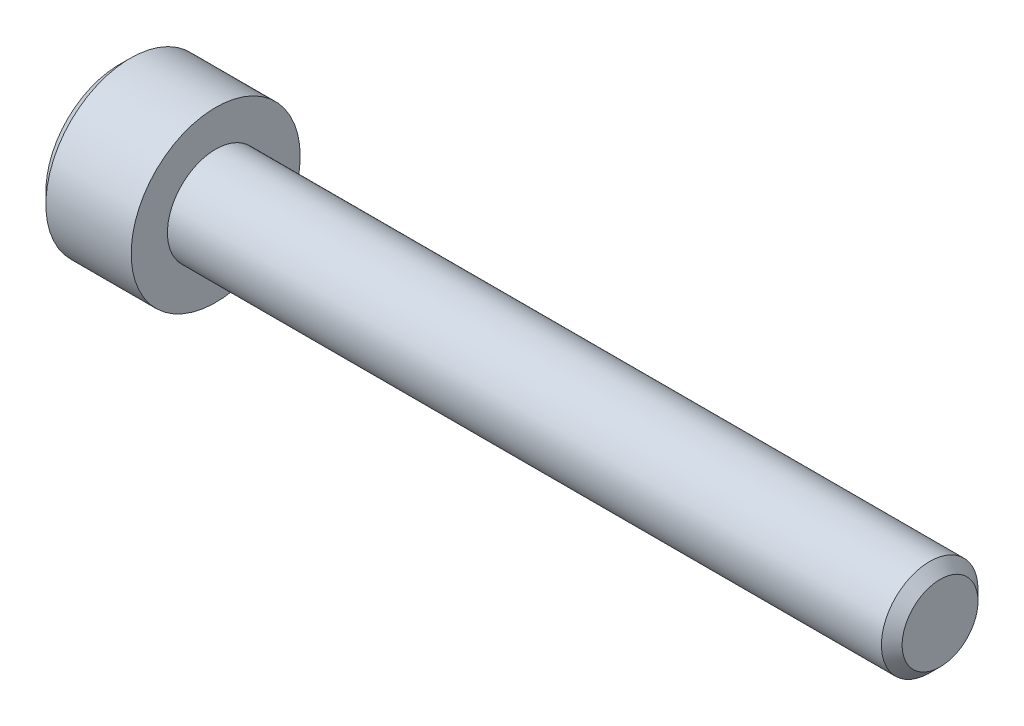
ISO-10303-21;
HEADER;
FILE_DESCRIPTION(('STEP AP214'),'2;1');
FILE_NAME('part.step','',(''),(''),'','','');
FILE_SCHEMA(('AUTOMOTIVE_DESIGN { 1 0 10303 214 1 1 1 1 }'));
ENDSEC;
DATA;
#1=APPLICATION_CONTEXT('core data for automotive mechanical design processes');
#2=APPLICATION_PROTOCOL_DEFINITION('international standard','automotive_design',2000,#1);
#3=PRODUCT_CONTEXT('',#1,'mechanical');
#4=PRODUCT('Part','Part','',(#3));
#5=PRODUCT_RELATED_PRODUCT_CATEGORY('part','',(#4));
#6=PRODUCT_DEFINITION_FORMATION('','',#4);
#7=PRODUCT_DEFINITION_CONTEXT('part definition',#1,'design');
#8=PRODUCT_DEFINITION('design','',#6,#7);
#9=PRODUCT_DEFINITION_SHAPE('','',#8);
#10=(LENGTH_UNIT() NAMED_UNIT(*) SI_UNIT(.MILLI.,.METRE.));
#11=(NAMED_UNIT(*) PLANE_ANGLE_UNIT() SI_UNIT($,.RADIAN.));
#12=(NAMED_UNIT(*) SI_UNIT($,.STERADIAN.) SOLID_ANGLE_UNIT());
#13=UNCERTAINTY_MEASURE_WITH_UNIT(LENGTH_MEASURE(1.E-05),#10,'distance_accuracy_value','');
#14=(GEOMETRIC_REPRESENTATION_CONTEXT(3) GLOBAL_UNCERTAINTY_ASSIGNED_CONTEXT((#13)) GLOBAL_UNIT_ASSIGNED_CONTEXT((#10,
#11,#12)) REPRESENTATION_CONTEXT('',''));
#15=CARTESIAN_POINT('',(0.,0.,0.));
#16=DIRECTION('',(0.,0.,1.));
#17=DIRECTION('',(1.,0.,0.));
#18=AXIS2_PLACEMENT_3D('',#15,#16,#17);
#19=CARTESIAN_POINT('',(-2.,0.,0.));
#20=DIRECTION('',(-1.,0.,0.));
#21=DIRECTION('',(0.,0.,1.));
#22=AXIS2_PLACEMENT_3D('',#19,#20,#21);
#23=CONICAL_SURFACE('',#22,1.5,1.30899693899575);
#24=CARTESIAN_POINT('',(-2.,0.,0.));
#25=DIRECTION('',(1.,0.,0.));
#26=DIRECTION('',(0.,0.,-1.));
#27=AXIS2_PLACEMENT_3D('',#24,#25,#26);
#28=CIRCLE('',#27,1.5);
#29=CARTESIAN_POINT('',(-2.,1.29903810567666,-0.75));
#30=VERTEX_POINT('',#29);
#31=CARTESIAN_POINT('',(-2.,1.29903810567666,0.75));
#32=VERTEX_POINT('',#31);
#33=EDGE_CURVE('E147',#30,#32,#28,.T.);
#34=ORIENTED_EDGE('',*,*,#33,.F.);
#35=CARTESIAN_POINT('',(-2.,0.,0.));
#36=DIRECTION('',(1.,0.,0.));
#37=DIRECTION('',(0.,0.,-1.));
#38=AXIS2_PLACEMENT_3D('',#35,#36,#37);
#39=CIRCLE('',#38,1.5);
#40=CARTESIAN_POINT('',(-2.,0.,-1.5));
#41=VERTEX_POINT('',#40);
#42=EDGE_CURVE('E255',#41,#30,#39,.T.);
#43=ORIENTED_EDGE('',*,*,#42,.F.);
#44=CARTESIAN_POINT('',(-2.,0.,0.));
#45=DIRECTION('',(1.,0.,0.));
#46=DIRECTION('',(0.,0.,-1.));
#47=AXIS2_PLACEMENT_3D('',#44,#45,#46);
#48=CIRCLE('',#47,1.5);
#49=CARTESIAN_POINT('',(-2.,-1.29903810567666,-0.75));
#50=VERTEX_POINT('',#49);
#51=EDGE_CURVE('E10',#50,#41,#48,.T.);
#52=ORIENTED_EDGE('',*,*,#51,.F.);
#53=CARTESIAN_POINT('',(-2.,0.,0.));
#54=DIRECTION('',(1.,0.,0.));
#55=DIRECTION('',(0.,0.,-1.));
#56=AXIS2_PLACEMENT_3D('',#53,#54,#55);
#57=CIRCLE('',#56,1.5);
#58=CARTESIAN_POINT('',(-2.,-1.29903810567666,0.75));
#59=VERTEX_POINT('',#58);
#60=EDGE_CURVE('E25',#59,#50,#57,.T.);
#61=ORIENTED_EDGE('',*,*,#60,.F.);
#62=CARTESIAN_POINT('',(-2.,0.,0.));
#63=DIRECTION('',(1.,0.,0.));
#64=DIRECTION('',(0.,0.,-1.));
#65=AXIS2_PLACEMENT_3D('',#62,#63,#64);
#66=CIRCLE('',#65,1.5);
#67=CARTESIAN_POINT('',(-2.,0.,1.5));
#68=VERTEX_POINT('',#67);
#69=EDGE_CURVE('E129',#68,#59,#66,.T.);
#70=ORIENTED_EDGE('',*,*,#69,.F.);
#71=CARTESIAN_POINT('',(-2.,0.,0.));
#72=DIRECTION('',(1.,0.,0.));
#73=DIRECTION('',(0.,0.,-1.));
#74=AXIS2_PLACEMENT_3D('',#71,#72,#73);
#75=CIRCLE('',#74,1.5);
#76=EDGE_CURVE('E37',#32,#68,#75,.T.);
#77=ORIENTED_EDGE('',*,*,#76,.F.);
#78=EDGE_LOOP('',(#34,#43,#52,#61,#70,#77));
#79=FACE_BOUND('',#78,.T.);
#80=CARTESIAN_POINT('',(-1.59807621135332,0.,0.));
#81=VERTEX_POINT('',#80);
#82=VERTEX_LOOP('',#81);
#83=FACE_BOUND('',#82,.T.);
#84=ADVANCED_FACE('F16',(#79,#83),#23,.F.);
#85=CARTESIAN_POINT('',(-2.,0.,0.));
#86=DIRECTION('',(1.,0.,0.));
#87=DIRECTION('',(0.,1.,0.));
#88=AXIS2_PLACEMENT_3D('',#85,#86,#87);
#89=PLANE('',#88);
#90=ORIENTED_EDGE('',*,*,#51,.T.);
#91=DIRECTION('',(0.,1.,0.));
#92=VECTOR('',#91,1.);
#93=CARTESIAN_POINT('',(-2.,-0.866025403784439,-1.5));
#94=LINE('',#93,#92);
#95=CARTESIAN_POINT('',(-2.,-0.866025403784439,-1.5));
#96=VERTEX_POINT('',#95);
#97=EDGE_CURVE('E228',#96,#41,#94,.T.);
#98=ORIENTED_EDGE('',*,*,#97,.F.);
#99=DIRECTION('',(0.,0.5,-0.866025403784439));
#100=VECTOR('',#99,1.);
#101=CARTESIAN_POINT('',(-2.,-1.73205080756888,0.));
#102=LINE('',#101,#100);
#103=EDGE_CURVE('E221',#50,#96,#102,.T.);
#104=ORIENTED_EDGE('',*,*,#103,.F.);
#105=EDGE_LOOP('',(#90,#98,#104));
#106=FACE_BOUND('',#105,.T.);
#107=ADVANCED_FACE('F268',(#106),#89,.F.);
#108=CARTESIAN_POINT('',(-2.,0.,0.));
#109=DIRECTION('',(1.,0.,0.));
#110=DIRECTION('',(0.,1.,0.));
#111=AXIS2_PLACEMENT_3D('',#108,#109,#110);
#112=PLANE('',#111);
#113=ORIENTED_EDGE('',*,*,#60,.T.);
#114=DIRECTION('',(0.,0.5,-0.866025403784439));
#115=VECTOR('',#114,1.);
#116=CARTESIAN_POINT('',(-2.,-1.73205080756888,0.));
#117=LINE('',#116,#115);
#118=CARTESIAN_POINT('',(-2.,-1.73205080756888,0.));
#119=VERTEX_POINT('',#118);
#120=EDGE_CURVE('E217',#119,#50,#117,.T.);
#121=ORIENTED_EDGE('',*,*,#120,.F.);
#122=DIRECTION('',(0.,-0.5,-0.866025403784439));
#123=VECTOR('',#122,1.);
#124=CARTESIAN_POINT('',(-2.,-0.866025403784439,1.5));
#125=LINE('',#124,#123);
#126=EDGE_CURVE('E210',#59,#119,#125,.T.);
#127=ORIENTED_EDGE('',*,*,#126,.F.);
#128=EDGE_LOOP('',(#113,#121,#127));
#129=FACE_BOUND('',#128,.T.);
#130=ADVANCED_FACE('F265',(#129),#112,.F.);
#131=CARTESIAN_POINT('',(-2.,0.,0.));
#132=DIRECTION('',(1.,0.,0.));
#133=DIRECTION('',(0.,1.,0.));
#134=AXIS2_PLACEMENT_3D('',#131,#132,#133);
#135=PLANE('',#134);
#136=ORIENTED_EDGE('',*,*,#69,.T.);
#137=DIRECTION('',(0.,-0.5,-0.866025403784439));
#138=VECTOR('',#137,1.);
#139=CARTESIAN_POINT('',(-2.,-0.866025403784439,1.5));
#140=LINE('',#139,#138);
#141=CARTESIAN_POINT('',(-2.,-0.866025403784439,1.5));
#142=VERTEX_POINT('',#141);
#143=EDGE_CURVE('E153',#142,#59,#140,.T.);
#144=ORIENTED_EDGE('',*,*,#143,.F.);
#145=DIRECTION('',(0.,-1.,0.));
#146=VECTOR('',#145,1.);
#147=CARTESIAN_POINT('',(-2.,0.866025403784439,1.5));
#148=LINE('',#147,#146);
#149=EDGE_CURVE('E150',#68,#142,#148,.T.);
#150=ORIENTED_EDGE('',*,*,#149,.F.);
#151=EDGE_LOOP('',(#136,#144,#150));
#152=FACE_BOUND('',#151,.T.);
#153=ADVANCED_FACE('F151',(#152),#135,.F.);
#154=CARTESIAN_POINT('',(-2.,0.,0.));
#155=DIRECTION('',(1.,0.,0.));
#156=DIRECTION('',(0.,1.,0.));
#157=AXIS2_PLACEMENT_3D('',#154,#155,#156);
#158=PLANE('',#157);
#159=ORIENTED_EDGE('',*,*,#76,.T.);
#160=DIRECTION('',(0.,-1.,0.));
#161=VECTOR('',#160,1.);
#162=CARTESIAN_POINT('',(-2.,0.866025403784439,1.5));
#163=LINE('',#162,#161);
#164=CARTESIAN_POINT('',(-2.,0.866025403784439,1.5));
#165=VERTEX_POINT('',#164);
#166=EDGE_CURVE('E142',#165,#68,#163,.T.);
#167=ORIENTED_EDGE('',*,*,#166,.F.);
#168=DIRECTION('',(0.,-0.5,0.866025403784439));
#169=VECTOR('',#168,1.);
#170=CARTESIAN_POINT('',(-2.,1.73205080756888,0.));
#171=LINE('',#170,#169);
#172=EDGE_CURVE('E144',#32,#165,#171,.T.);
#173=ORIENTED_EDGE('',*,*,#172,.F.);
#174=EDGE_LOOP('',(#159,#167,#173));
#175=FACE_BOUND('',#174,.T.);
#176=ADVANCED_FACE('F140',(#175),#158,.F.);
#177=CARTESIAN_POINT('',(-2.,0.,0.));
#178=DIRECTION('',(1.,0.,0.));
#179=DIRECTION('',(0.,1.,0.));
#180=AXIS2_PLACEMENT_3D('',#177,#178,#179);
#181=PLANE('',#180);
#182=DIRECTION('',(0.,0.5,0.866025403784439));
#183=VECTOR('',#182,1.);
#184=CARTESIAN_POINT('',(-2.,0.866025403784439,-1.5));
#185=LINE('',#184,#183);
#186=CARTESIAN_POINT('',(-2.,1.73205080756888,0.));
#187=VERTEX_POINT('',#186);
#188=EDGE_CURVE('E243',#30,#187,#185,.T.);
#189=ORIENTED_EDGE('',*,*,#188,.F.);
#190=ORIENTED_EDGE('',*,*,#33,.T.);
#191=DIRECTION('',(0.,-0.5,0.866025403784439));
#192=VECTOR('',#191,1.);
#193=CARTESIAN_POINT('',(-2.,1.73205080756888,0.));
#194=LINE('',#193,#192);
#195=EDGE_CURVE('E250',#187,#32,#194,.T.);
#196=ORIENTED_EDGE('',*,*,#195,.F.);
#197=EDGE_LOOP('',(#189,#190,#196));
#198=FACE_BOUND('',#197,.T.);
#199=ADVANCED_FACE('F288',(#198),#181,.F.);
#200=CARTESIAN_POINT('',(-2.,0.,0.));
#201=DIRECTION('',(1.,0.,0.));
#202=DIRECTION('',(0.,1.,0.));
#203=AXIS2_PLACEMENT_3D('',#200,#201,#202);
#204=PLANE('',#203);
#205=ORIENTED_EDGE('',*,*,#42,.T.);
#206=DIRECTION('',(0.,0.5,0.866025403784439));
#207=VECTOR('',#206,1.);
#208=CARTESIAN_POINT('',(-2.,0.866025403784439,-1.5));
#209=LINE('',#208,#207);
#210=CARTESIAN_POINT('',(-2.,0.866025403784438,-1.5));
#211=VERTEX_POINT('',#210);
#212=EDGE_CURVE('E239',#211,#30,#209,.T.);
#213=ORIENTED_EDGE('',*,*,#212,.F.);
#214=DIRECTION('',(0.,1.,0.));
#215=VECTOR('',#214,1.);
#216=CARTESIAN_POINT('',(-2.,-0.866025403784439,-1.5));
#217=LINE('',#216,#215);
#218=EDGE_CURVE('E232',#41,#211,#217,.T.);
#219=ORIENTED_EDGE('',*,*,#218,.F.);
#220=EDGE_LOOP('',(#205,#213,#219));
#221=FACE_BOUND('',#220,.T.);
#222=ADVANCED_FACE('F291',(#221),#204,.F.);
#223=CARTESIAN_POINT('',(-2.,1.73205080756888,0.));
#224=DIRECTION('',(0.,-0.866025403784439,-0.5));
#225=DIRECTION('',(0.,0.5,-0.866025403784439));
#226=AXIS2_PLACEMENT_3D('',#223,#224,#225);
#227=PLANE('',#226);
#228=DIRECTION('',(0.,-0.5,0.866025403784439));
#229=VECTOR('',#228,1.);
#230=CARTESIAN_POINT('',(-4.,1.73205080756888,0.));
#231=LINE('',#230,#229);
#232=CARTESIAN_POINT('',(-4.,1.73205080756888,0.));
#233=VERTEX_POINT('',#232);
#234=CARTESIAN_POINT('',(-4.,0.866025403784439,1.5));
#235=VERTEX_POINT('',#234);
#236=EDGE_CURVE('E182',#233,#235,#231,.T.);
#237=ORIENTED_EDGE('',*,*,#236,.F.);
#238=DIRECTION('',(-1.,0.,0.));
#239=VECTOR('',#238,1.);
#240=CARTESIAN_POINT('',(-2.,1.73205080756888,0.));
#241=LINE('',#240,#239);
#242=EDGE_CURVE('E247',#187,#233,#241,.T.);
#243=ORIENTED_EDGE('',*,*,#242,.F.);
#244=ORIENTED_EDGE('',*,*,#195,.T.);
#245=ORIENTED_EDGE('',*,*,#172,.T.);
#246=DIRECTION('',(-1.,0.,0.));
#247=VECTOR('',#246,1.);
#248=CARTESIAN_POINT('',(-2.,0.866025403784439,1.5));
#249=LINE('',#248,#247);
#250=EDGE_CURVE('E161',#165,#235,#249,.T.);
#251=ORIENTED_EDGE('',*,*,#250,.T.);
#252=EDGE_LOOP('',(#237,#243,#244,#245,#251));
#253=FACE_BOUND('',#252,.T.);
#254=ADVANCED_FACE('F285',(#253),#227,.T.);
#255=CARTESIAN_POINT('',(-2.,0.866025403784439,-1.5));
#256=DIRECTION('',(0.,-0.866025403784439,0.5));
#257=DIRECTION('',(-1.,0.,0.));
#258=AXIS2_PLACEMENT_3D('',#255,#256,#257);
#259=PLANE('',#258);
#260=DIRECTION('',(0.,0.5,0.866025403784439));
#261=VECTOR('',#260,1.);
#262=CARTESIAN_POINT('',(-4.,0.866025403784439,-1.5));
#263=LINE('',#262,#261);
#264=CARTESIAN_POINT('',(-4.,0.866025403784438,-1.5));
#265=VERTEX_POINT('',#264);
#266=EDGE_CURVE('E178',#265,#233,#263,.T.);
#267=ORIENTED_EDGE('',*,*,#266,.F.);
#268=DIRECTION('',(-1.,0.,0.));
#269=VECTOR('',#268,1.);
#270=CARTESIAN_POINT('',(-2.,0.866025403784438,-1.5));
#271=LINE('',#270,#269);
#272=EDGE_CURVE('E236',#211,#265,#271,.T.);
#273=ORIENTED_EDGE('',*,*,#272,.F.);
#274=ORIENTED_EDGE('',*,*,#212,.T.);
#275=ORIENTED_EDGE('',*,*,#188,.T.);
#276=ORIENTED_EDGE('',*,*,#242,.T.);
#277=EDGE_LOOP('',(#267,#273,#274,#275,#276));
#278=FACE_BOUND('',#277,.T.);
#279=ADVANCED_FACE('F338',(#278),#259,.T.);
#280=CARTESIAN_POINT('',(-2.,-0.866025403784439,-1.5));
#281=DIRECTION('',(0.,0.,1.));
#282=DIRECTION('',(1.,0.,0.));
#283=AXIS2_PLACEMENT_3D('',#280,#281,#282);
#284=PLANE('',#283);
#285=DIRECTION('',(0.,1.,0.));
#286=VECTOR('',#285,1.);
#287=CARTESIAN_POINT('',(-4.,-0.866025403784439,-1.5));
#288=LINE('',#287,#286);
#289=CARTESIAN_POINT('',(-4.,-0.866025403784439,-1.5));
#290=VERTEX_POINT('',#289);
#291=EDGE_CURVE('E174',#290,#265,#288,.T.);
#292=ORIENTED_EDGE('',*,*,#291,.F.);
#293=DIRECTION('',(-1.,0.,0.));
#294=VECTOR('',#293,1.);
#295=CARTESIAN_POINT('',(-2.,-0.866025403784439,-1.5));
#296=LINE('',#295,#294);
#297=EDGE_CURVE('E225',#96,#290,#296,.T.);
#298=ORIENTED_EDGE('',*,*,#297,.F.);
#299=ORIENTED_EDGE('',*,*,#97,.T.);
#300=ORIENTED_EDGE('',*,*,#218,.T.);
#301=ORIENTED_EDGE('',*,*,#272,.T.);
#302=EDGE_LOOP('',(#292,#298,#299,#300,#301));
#303=FACE_BOUND('',#302,.T.);
#304=ADVANCED_FACE('F295',(#303),#284,.T.);
#305=CARTESIAN_POINT('',(-2.,-1.73205080756888,0.));
#306=DIRECTION('',(0.,0.866025403784439,0.5));
#307=DIRECTION('',(1.,0.,0.));
#308=AXIS2_PLACEMENT_3D('',#305,#306,#307);
#309=PLANE('',#308);
#310=DIRECTION('',(0.,0.5,-0.866025403784439));
#311=VECTOR('',#310,1.);
#312=CARTESIAN_POINT('',(-4.,-1.73205080756888,0.));
#313=LINE('',#312,#311);
#314=CARTESIAN_POINT('',(-4.,-1.73205080756888,0.));
#315=VERTEX_POINT('',#314);
#316=EDGE_CURVE('E172',#315,#290,#313,.T.);
#317=ORIENTED_EDGE('',*,*,#316,.F.);
#318=DIRECTION('',(-1.,0.,0.));
#319=VECTOR('',#318,1.);
#320=CARTESIAN_POINT('',(-2.,-1.73205080756888,0.));
#321=LINE('',#320,#319);
#322=EDGE_CURVE('E214',#119,#315,#321,.T.);
#323=ORIENTED_EDGE('',*,*,#322,.F.);
#324=ORIENTED_EDGE('',*,*,#120,.T.);
#325=ORIENTED_EDGE('',*,*,#103,.T.);
#326=ORIENTED_EDGE('',*,*,#297,.T.);
#327=EDGE_LOOP('',(#317,#323,#324,#325,#326));
#328=FACE_BOUND('',#327,.T.);
#329=ADVANCED_FACE('F273',(#328),#309,.T.);
#330=CARTESIAN_POINT('',(-2.,-0.866025403784439,1.5));
#331=DIRECTION('',(0.,0.866025403784439,-0.5));
#332=DIRECTION('',(-1.,0.,0.));
#333=AXIS2_PLACEMENT_3D('',#330,#331,#332);
#334=PLANE('',#333);
#335=DIRECTION('',(0.,-0.5,-0.866025403784439));
#336=VECTOR('',#335,1.);
#337=CARTESIAN_POINT('',(-4.,-0.866025403784439,1.5));
#338=LINE('',#337,#336);
#339=CARTESIAN_POINT('',(-4.,-0.866025403784439,1.5));
#340=VERTEX_POINT('',#339);
#341=EDGE_CURVE('E190',#340,#315,#338,.T.);
#342=ORIENTED_EDGE('',*,*,#341,.F.);
#343=DIRECTION('',(-1.,0.,0.));
#344=VECTOR('',#343,1.);
#345=CARTESIAN_POINT('',(-2.,-0.866025403784439,1.5));
#346=LINE('',#345,#344);
#347=EDGE_CURVE('E157',#142,#340,#346,.T.);
#348=ORIENTED_EDGE('',*,*,#347,.F.);
#349=ORIENTED_EDGE('',*,*,#143,.T.);
#350=ORIENTED_EDGE('',*,*,#126,.T.);
#351=ORIENTED_EDGE('',*,*,#322,.T.);
#352=EDGE_LOOP('',(#342,#348,#349,#350,#351));
#353=FACE_BOUND('',#352,.T.);
#354=ADVANCED_FACE('F277',(#353),#334,.T.);
#355=CARTESIAN_POINT('',(-2.,0.866025403784439,1.5));
#356=DIRECTION('',(0.,0.,-1.));
#357=DIRECTION('',(0.,-1.,0.));
#358=AXIS2_PLACEMENT_3D('',#355,#356,#357);
#359=PLANE('',#358);
#360=DIRECTION('',(0.,-1.,0.));
#361=VECTOR('',#360,1.);
#362=CARTESIAN_POINT('',(-4.,0.866025403784439,1.5));
#363=LINE('',#362,#361);
#364=EDGE_CURVE('E186',#235,#340,#363,.T.);
#365=ORIENTED_EDGE('',*,*,#364,.F.);
#366=ORIENTED_EDGE('',*,*,#250,.F.);
#367=ORIENTED_EDGE('',*,*,#166,.T.);
#368=ORIENTED_EDGE('',*,*,#149,.T.);
#369=ORIENTED_EDGE('',*,*,#347,.T.);
#370=EDGE_LOOP('',(#365,#366,#367,#368,#369));
#371=FACE_BOUND('',#370,.T.);
#372=ADVANCED_FACE('F160',(#371),#359,.T.);
#373=CARTESIAN_POINT('',(30.,1.5705,0.));
#374=DIRECTION('',(-1.,0.,0.));
#375=DIRECTION('',(0.,0.,1.));
#376=AXIS2_PLACEMENT_3D('',#373,#374,#375);
#377=PLANE('',#376);
#378=CARTESIAN_POINT('',(30.,0.,0.));
#379=DIRECTION('',(1.,0.,0.));
#380=DIRECTION('',(0.,0.,-1.));
#381=AXIS2_PLACEMENT_3D('',#378,#379,#380);
#382=CIRCLE('',#381,1.5705);
#383=CARTESIAN_POINT('',(30.,0.,-1.5705));
#384=VERTEX_POINT('',#383);
#385=EDGE_CURVE('E168',#384,#384,#382,.T.);
#386=ORIENTED_EDGE('',*,*,#385,.T.);
#387=EDGE_LOOP('',(#386));
#388=FACE_BOUND('',#387,.T.);
#389=ADVANCED_FACE('F311',(#388),#377,.F.);
#390=CARTESIAN_POINT('',(29.5705,0.,0.));
#391=DIRECTION('',(-1.,0.,0.));
#392=DIRECTION('',(0.,0.,1.));
#393=AXIS2_PLACEMENT_3D('',#390,#391,#392);
#394=CONICAL_SURFACE('',#393,2.,0.785398163397445);
#395=CARTESIAN_POINT('',(29.5705,0.,0.));
#396=DIRECTION('',(1.,0.,0.));
#397=DIRECTION('',(0.,0.,-1.));
#398=AXIS2_PLACEMENT_3D('',#395,#396,#397);
#399=CIRCLE('',#398,2.);
#400=CARTESIAN_POINT('',(29.5705,0.,-2.));
#401=VERTEX_POINT('',#400);
#402=EDGE_CURVE('E191',#401,#401,#399,.T.);
#403=ORIENTED_EDGE('',*,*,#402,.T.);
#404=EDGE_LOOP('',(#403));
#405=FACE_BOUND('',#404,.T.);
#406=ORIENTED_EDGE('',*,*,#385,.F.);
#407=EDGE_LOOP('',(#406));
#408=FACE_BOUND('',#407,.T.);
#409=ADVANCED_FACE('F313',(#405,#408),#394,.T.);
#410=CARTESIAN_POINT('',(30.,0.,0.));
#411=DIRECTION('',(1.,0.,0.));
#412=DIRECTION('',(0.,0.,-1.));
#413=AXIS2_PLACEMENT_3D('',#410,#411,#412);
#414=CYLINDRICAL_SURFACE('',#413,2.);
#415=CARTESIAN_POINT('',(0.,0.,0.));
#416=DIRECTION('',(1.,0.,0.));
#417=DIRECTION('',(0.,0.,-1.));
#418=AXIS2_PLACEMENT_3D('',#415,#416,#417);
#419=CIRCLE('',#418,2.);
#420=CARTESIAN_POINT('',(0.,0.,-2.));
#421=VERTEX_POINT('',#420);
#422=EDGE_CURVE('E194',#421,#421,#419,.T.);
#423=ORIENTED_EDGE('',*,*,#422,.T.);
#424=EDGE_LOOP('',(#423));
#425=FACE_BOUND('',#424,.T.);
#426=ORIENTED_EDGE('',*,*,#402,.F.);
#427=EDGE_LOOP('',(#426));
#428=FACE_BOUND('',#427,.T.);
#429=ADVANCED_FACE('F315',(#425,#428),#414,.T.);
#430=CARTESIAN_POINT('',(0.,3.5,0.));
#431=DIRECTION('',(-1.,0.,0.));
#432=DIRECTION('',(0.,0.,1.));
#433=AXIS2_PLACEMENT_3D('',#430,#431,#432);
#434=PLANE('',#433);
#435=CARTESIAN_POINT('',(0.,0.,0.));
#436=DIRECTION('',(1.,0.,0.));
#437=DIRECTION('',(0.,0.,-1.));
#438=AXIS2_PLACEMENT_3D('',#435,#436,#437);
#439=CIRCLE('',#438,3.5);
#440=CARTESIAN_POINT('',(0.,0.,-3.5));
#441=VERTEX_POINT('',#440);
#442=EDGE_CURVE('E197',#441,#441,#439,.T.);
#443=ORIENTED_EDGE('',*,*,#442,.T.);
#444=EDGE_LOOP('',(#443));
#445=FACE_BOUND('',#444,.T.);
#446=ORIENTED_EDGE('',*,*,#422,.F.);
#447=EDGE_LOOP('',(#446));
#448=FACE_BOUND('',#447,.T.);
#449=ADVANCED_FACE('F323',(#445,#448),#434,.F.);
#450=CARTESIAN_POINT('',(30.,0.,0.));
#451=DIRECTION('',(1.,0.,0.));
#452=DIRECTION('',(0.,0.,-1.));
#453=AXIS2_PLACEMENT_3D('',#450,#451,#452);
#454=CYLINDRICAL_SURFACE('',#453,3.5);
#455=CARTESIAN_POINT('',(-3.53333333333333,0.,0.));
#456=DIRECTION('',(1.,0.,0.));
#457=DIRECTION('',(0.,0.,-1.));
#458=AXIS2_PLACEMENT_3D('',#455,#456,#457);
#459=CIRCLE('',#458,3.5);
#460=CARTESIAN_POINT('',(-3.53333333333333,0.,-3.5));
#461=VERTEX_POINT('',#460);
#462=EDGE_CURVE('E198',#461,#461,#459,.T.);
#463=ORIENTED_EDGE('',*,*,#462,.T.);
#464=EDGE_LOOP('',(#463));
#465=FACE_BOUND('',#464,.T.);
#466=ORIENTED_EDGE('',*,*,#442,.F.);
#467=EDGE_LOOP('',(#466));
#468=FACE_BOUND('',#467,.T.);
#469=ADVANCED_FACE('F366',(#465,#468),#454,.T.);
#470=CARTESIAN_POINT('',(-4.,0.,0.));
#471=DIRECTION('',(1.,0.,0.));
#472=DIRECTION('',(0.,0.,-1.));
#473=AXIS2_PLACEMENT_3D('',#470,#471,#472);
#474=CONICAL_SURFACE('',#473,3.03333333333333,0.785398163397444);
#475=CARTESIAN_POINT('',(-4.,0.,0.));
#476=DIRECTION('',(1.,0.,0.));
#477=DIRECTION('',(0.,0.,-1.));
#478=AXIS2_PLACEMENT_3D('',#475,#476,#477);
#479=CIRCLE('',#478,3.03333333333333);
#480=CARTESIAN_POINT('',(-4.,0.,-3.03333333333333));
#481=VERTEX_POINT('',#480);
#482=EDGE_CURVE('E297',#481,#481,#479,.T.);
#483=ORIENTED_EDGE('',*,*,#482,.T.);
#484=EDGE_LOOP('',(#483));
#485=FACE_BOUND('',#484,.T.);
#486=ORIENTED_EDGE('',*,*,#462,.F.);
#487=EDGE_LOOP('',(#486));
#488=FACE_BOUND('',#487,.T.);
#489=ADVANCED_FACE('F370',(#485,#488),#474,.T.);
#490=CARTESIAN_POINT('',(-4.,0.,0.));
#491=DIRECTION('',(1.,0.,0.));
#492=DIRECTION('',(0.,1.,0.));
#493=AXIS2_PLACEMENT_3D('',#490,#491,#492);
#494=PLANE('',#493);
#495=ORIENTED_EDGE('',*,*,#316,.T.);
#496=ORIENTED_EDGE('',*,*,#291,.T.);
#497=ORIENTED_EDGE('',*,*,#266,.T.);
#498=ORIENTED_EDGE('',*,*,#236,.T.);
#499=ORIENTED_EDGE('',*,*,#364,.T.);
#500=ORIENTED_EDGE('',*,*,#341,.T.);
#501=EDGE_LOOP('',(#495,#496,#497,#498,#499,#500));
#502=FACE_BOUND('',#501,.T.);
#503=ORIENTED_EDGE('',*,*,#482,.F.);
#504=EDGE_LOOP('',(#503));
#505=FACE_BOUND('',#504,.T.);
#506=ADVANCED_FACE('F280',(#502,#505),#494,.F.);
#507=CLOSED_SHELL('',(#84,#107,#130,#153,#176,#199,#222,#254,#279,#304,#329,#354,#372,#389,#409,
#429,#449,#469,#489,#506));
#508=MANIFOLD_SOLID_BREP('B1',#507);
#509=ADVANCED_BREP_SHAPE_REPRESENTATION('',(#18,#508),#14);
#510=SHAPE_DEFINITION_REPRESENTATION(#9,#509);
ENDSEC;
END-ISO-10303-21;
